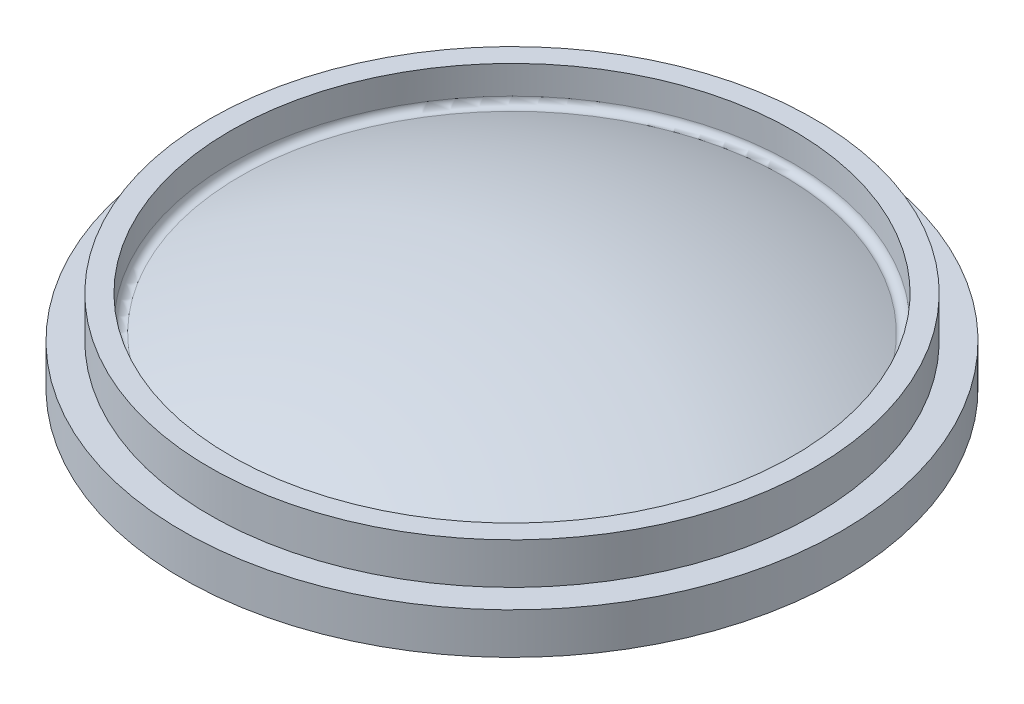
ISO-10303-21;
HEADER;
FILE_DESCRIPTION(('STEP AP214'),'2;1');
FILE_NAME('part.step','',(''),(''),'','','');
FILE_SCHEMA(('AUTOMOTIVE_DESIGN { 1 0 10303 214 1 1 1 1 }'));
ENDSEC;
DATA;
#1=APPLICATION_CONTEXT('core data for automotive mechanical design processes');
#2=APPLICATION_PROTOCOL_DEFINITION('international standard','automotive_design',2000,#1);
#3=PRODUCT_CONTEXT('',#1,'mechanical');
#4=PRODUCT('Part','Part','',(#3));
#5=PRODUCT_RELATED_PRODUCT_CATEGORY('part','',(#4));
#6=PRODUCT_DEFINITION_FORMATION('','',#4);
#7=PRODUCT_DEFINITION_CONTEXT('part definition',#1,'design');
#8=PRODUCT_DEFINITION('design','',#6,#7);
#9=PRODUCT_DEFINITION_SHAPE('','',#8);
#10=(LENGTH_UNIT() NAMED_UNIT(*) SI_UNIT(.MILLI.,.METRE.));
#11=(NAMED_UNIT(*) PLANE_ANGLE_UNIT() SI_UNIT($,.RADIAN.));
#12=(NAMED_UNIT(*) SI_UNIT($,.STERADIAN.) SOLID_ANGLE_UNIT());
#13=UNCERTAINTY_MEASURE_WITH_UNIT(LENGTH_MEASURE(1.E-05),#10,'distance_accuracy_value','');
#14=(GEOMETRIC_REPRESENTATION_CONTEXT(3) GLOBAL_UNCERTAINTY_ASSIGNED_CONTEXT((#13)) GLOBAL_UNIT_ASSIGNED_CONTEXT((#10,
#11,#12)) REPRESENTATION_CONTEXT('',''));
#15=CARTESIAN_POINT('',(0.,0.,0.));
#16=DIRECTION('',(0.,0.,1.));
#17=DIRECTION('',(1.,0.,0.));
#18=AXIS2_PLACEMENT_3D('',#15,#16,#17);
#19=CARTESIAN_POINT('',(0.,49.2125,0.));
#20=DIRECTION('',(0.,1.,0.));
#21=DIRECTION('',(-1.,0.,0.));
#22=AXIS2_PLACEMENT_3D('',#19,#20,#21);
#23=CYLINDRICAL_SURFACE('',#22,139.7);
#24=CARTESIAN_POINT('',(0.,38.0999999999999,0.));
#25=DIRECTION('',(0.,1.,0.));
#26=DIRECTION('',(-1.,0.,0.));
#27=AXIS2_PLACEMENT_3D('',#24,#25,#26);
#28=CIRCLE('',#27,139.7);
#29=CARTESIAN_POINT('',(-139.7,38.0999999999999,0.));
#30=VERTEX_POINT('',#29);
#31=EDGE_CURVE('E51',#30,#30,#28,.T.);
#32=ORIENTED_EDGE('',*,*,#31,.F.);
#33=EDGE_LOOP('',(#32));
#34=FACE_BOUND('',#33,.T.);
#35=CARTESIAN_POINT('',(0.,19.0499999999999,0.));
#36=DIRECTION('',(0.,1.,0.));
#37=DIRECTION('',(-1.,0.,0.));
#38=AXIS2_PLACEMENT_3D('',#35,#36,#37);
#39=CIRCLE('',#38,139.7);
#40=CARTESIAN_POINT('',(-139.7,19.0499999999999,0.));
#41=VERTEX_POINT('',#40);
#42=EDGE_CURVE('E73',#41,#41,#39,.T.);
#43=ORIENTED_EDGE('',*,*,#42,.T.);
#44=EDGE_LOOP('',(#43));
#45=FACE_BOUND('',#44,.T.);
#46=ADVANCED_FACE('F37',(#34,#45),#23,.T.);
#47=CARTESIAN_POINT('',(139.7,38.1,0.));
#48=DIRECTION('',(0.,-1.,0.));
#49=DIRECTION('',(1.,0.,0.));
#50=AXIS2_PLACEMENT_3D('',#47,#48,#49);
#51=PLANE('',#50);
#52=CARTESIAN_POINT('',(0.,38.0999999999999,0.));
#53=DIRECTION('',(0.,1.,0.));
#54=DIRECTION('',(-1.,0.,0.));
#55=AXIS2_PLACEMENT_3D('',#52,#53,#54);
#56=CIRCLE('',#55,130.175);
#57=CARTESIAN_POINT('',(-130.175,38.0999999999999,0.));
#58=VERTEX_POINT('',#57);
#59=EDGE_CURVE('E56',#58,#58,#56,.T.);
#60=ORIENTED_EDGE('',*,*,#59,.F.);
#61=EDGE_LOOP('',(#60));
#62=FACE_BOUND('',#61,.T.);
#63=ORIENTED_EDGE('',*,*,#31,.T.);
#64=EDGE_LOOP('',(#63));
#65=FACE_BOUND('',#64,.T.);
#66=ADVANCED_FACE('F113',(#62,#65),#51,.F.);
#67=CARTESIAN_POINT('',(0.,49.2125,0.));
#68=DIRECTION('',(0.,1.,0.));
#69=DIRECTION('',(-1.,0.,0.));
#70=AXIS2_PLACEMENT_3D('',#67,#68,#69);
#71=CYLINDRICAL_SURFACE('',#70,130.175);
#72=CARTESIAN_POINT('',(0.,24.9826349484652,0.));
#73=DIRECTION('',(0.,-1.,0.));
#74=DIRECTION('',(1.,0.,0.));
#75=AXIS2_PLACEMENT_3D('',#72,#73,#74);
#76=CIRCLE('',#75,130.175);
#77=CARTESIAN_POINT('',(130.175,24.9826349484653,0.));
#78=VERTEX_POINT('',#77);
#79=EDGE_CURVE('E10',#78,#78,#76,.T.);
#80=ORIENTED_EDGE('',*,*,#79,.T.);
#81=EDGE_LOOP('',(#80));
#82=FACE_BOUND('',#81,.T.);
#83=ORIENTED_EDGE('',*,*,#59,.T.);
#84=EDGE_LOOP('',(#83));
#85=FACE_BOUND('',#84,.T.);
#86=ADVANCED_FACE('F110',(#82,#85),#71,.F.);
#87=CARTESIAN_POINT('',(0.,-255.5875,0.));
#88=DIRECTION('',(0.,1.,0.));
#89=DIRECTION('',(1.,0.,0.));
#90=AXIS2_PLACEMENT_3D('',#87,#88,#89);
#91=SPHERICAL_SURFACE('',#90,304.8);
#92=CARTESIAN_POINT('',(-1.24687587454376E-13,22.0901593304398,0.));
#93=DIRECTION('',(0.,-1.,0.));
#94=DIRECTION('',(1.,0.,0.));
#95=AXIS2_PLACEMENT_3D('',#92,#93,#94);
#96=CIRCLE('',#95,125.690721649485);
#97=CARTESIAN_POINT('',(125.690721649484,22.0901593304398,0.));
#98=VERTEX_POINT('',#97);
#99=EDGE_CURVE('E45',#98,#98,#96,.F.);
#100=ORIENTED_EDGE('',*,*,#99,.T.);
#101=EDGE_LOOP('',(#100));
#102=FACE_BOUND('',#101,.T.);
#103=ADVANCED_FACE('F105',(#102),#91,.T.);
#104=CARTESIAN_POINT('',(0.,-247.65,0.));
#105=DIRECTION('',(0.,1.,0.));
#106=DIRECTION('',(1.,0.,0.));
#107=AXIS2_PLACEMENT_3D('',#104,#105,#106);
#108=SPHERICAL_SURFACE('',#107,292.1);
#109=CARTESIAN_POINT('',(0.,4.39281103366136,0.));
#110=DIRECTION('',(0.,1.,0.));
#111=DIRECTION('',(-1.,0.,0.));
#112=AXIS2_PLACEMENT_3D('',#109,#110,#111);
#113=CIRCLE('',#112,147.6375);
#114=CARTESIAN_POINT('',(-147.6375,4.3928110336613,0.));
#115=VERTEX_POINT('',#114);
#116=EDGE_CURVE('E61',#115,#115,#113,.T.);
#117=ORIENTED_EDGE('',*,*,#116,.F.);
#118=EDGE_LOOP('',(#117));
#119=FACE_BOUND('',#118,.T.);
#120=ADVANCED_FACE('F100',(#119),#108,.F.);
#121=CARTESIAN_POINT('',(0.,49.2125,0.));
#122=DIRECTION('',(0.,1.,0.));
#123=DIRECTION('',(-1.,0.,0.));
#124=AXIS2_PLACEMENT_3D('',#121,#122,#123);
#125=CYLINDRICAL_SURFACE('',#124,147.6375);
#126=CARTESIAN_POINT('',(0.,0.,0.));
#127=DIRECTION('',(0.,1.,0.));
#128=DIRECTION('',(-1.,0.,0.));
#129=AXIS2_PLACEMENT_3D('',#126,#127,#128);
#130=CIRCLE('',#129,147.6375);
#131=CARTESIAN_POINT('',(-147.6375,-1.35683662702415E-13,0.));
#132=VERTEX_POINT('',#131);
#133=EDGE_CURVE('E64',#132,#132,#130,.T.);
#134=ORIENTED_EDGE('',*,*,#133,.F.);
#135=EDGE_LOOP('',(#134));
#136=FACE_BOUND('',#135,.T.);
#137=ORIENTED_EDGE('',*,*,#116,.T.);
#138=EDGE_LOOP('',(#137));
#139=FACE_BOUND('',#138,.T.);
#140=ADVANCED_FACE('F94',(#136,#139),#125,.F.);
#141=CARTESIAN_POINT('',(152.4,0.,0.));
#142=DIRECTION('',(0.,1.,0.));
#143=DIRECTION('',(-1.,0.,0.));
#144=AXIS2_PLACEMENT_3D('',#141,#142,#143);
#145=PLANE('',#144);
#146=CARTESIAN_POINT('',(0.,0.,0.));
#147=DIRECTION('',(0.,1.,0.));
#148=DIRECTION('',(-1.,0.,0.));
#149=AXIS2_PLACEMENT_3D('',#146,#147,#148);
#150=CIRCLE('',#149,152.4);
#151=CARTESIAN_POINT('',(-152.4,-1.37822202175426E-13,0.));
#152=VERTEX_POINT('',#151);
#153=EDGE_CURVE('E67',#152,#152,#150,.T.);
#154=ORIENTED_EDGE('',*,*,#153,.F.);
#155=EDGE_LOOP('',(#154));
#156=FACE_BOUND('',#155,.T.);
#157=ORIENTED_EDGE('',*,*,#133,.T.);
#158=EDGE_LOOP('',(#157));
#159=FACE_BOUND('',#158,.T.);
#160=ADVANCED_FACE('F88',(#156,#159),#145,.F.);
#161=CARTESIAN_POINT('',(0.,49.2125,0.));
#162=DIRECTION('',(0.,1.,0.));
#163=DIRECTION('',(-1.,0.,0.));
#164=AXIS2_PLACEMENT_3D('',#161,#162,#163);
#165=CYLINDRICAL_SURFACE('',#164,152.4);
#166=CARTESIAN_POINT('',(0.,19.0499999999999,0.));
#167=DIRECTION('',(0.,1.,0.));
#168=DIRECTION('',(-1.,0.,0.));
#169=AXIS2_PLACEMENT_3D('',#166,#167,#168);
#170=CIRCLE('',#169,152.4);
#171=CARTESIAN_POINT('',(-152.4,19.0499999999999,0.));
#172=VERTEX_POINT('',#171);
#173=EDGE_CURVE('E70',#172,#172,#170,.T.);
#174=ORIENTED_EDGE('',*,*,#173,.F.);
#175=EDGE_LOOP('',(#174));
#176=FACE_BOUND('',#175,.T.);
#177=ORIENTED_EDGE('',*,*,#153,.T.);
#178=EDGE_LOOP('',(#177));
#179=FACE_BOUND('',#178,.T.);
#180=ADVANCED_FACE('F82',(#176,#179),#165,.T.);
#181=CARTESIAN_POINT('',(152.4,19.05,0.));
#182=DIRECTION('',(0.,-1.,0.));
#183=DIRECTION('',(1.,0.,0.));
#184=AXIS2_PLACEMENT_3D('',#181,#182,#183);
#185=PLANE('',#184);
#186=ORIENTED_EDGE('',*,*,#42,.F.);
#187=EDGE_LOOP('',(#186));
#188=FACE_BOUND('',#187,.T.);
#189=ORIENTED_EDGE('',*,*,#173,.T.);
#190=EDGE_LOOP('',(#189));
#191=FACE_BOUND('',#190,.T.);
#192=ADVANCED_FACE('F79',(#188,#191),#185,.F.);
#193=CARTESIAN_POINT('',(0.,24.9826349484652,0.));
#194=DIRECTION('',(0.,-1.,0.));
#195=DIRECTION('',(1.,0.,0.));
#196=AXIS2_PLACEMENT_3D('',#193,#194,#195);
#197=TOROIDAL_SURFACE('',#196,127.,3.175);
#198=ORIENTED_EDGE('',*,*,#79,.F.);
#199=EDGE_LOOP('',(#198));
#200=FACE_BOUND('',#199,.T.);
#201=ORIENTED_EDGE('',*,*,#99,.F.);
#202=EDGE_LOOP('',(#201));
#203=FACE_BOUND('',#202,.T.);
#204=ADVANCED_FACE('F39',(#200,#203),#197,.F.);
#205=CLOSED_SHELL('',(#46,#66,#86,#103,#120,#140,#160,#180,#192,#204));
#206=MANIFOLD_SOLID_BREP('B2',#205);
#207=ADVANCED_BREP_SHAPE_REPRESENTATION('',(#18,#206),#14);
#208=SHAPE_DEFINITION_REPRESENTATION(#9,#207);
ENDSEC;
END-ISO-10303-21;
